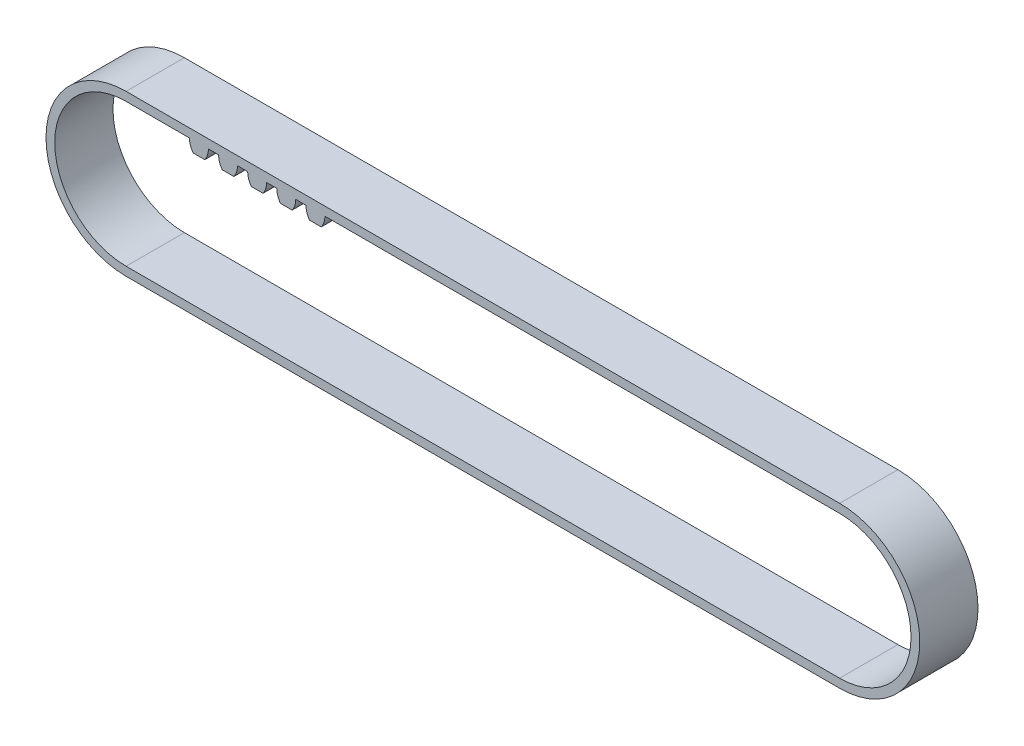
ISO-10303-21;
HEADER;
FILE_DESCRIPTION(('STEP AP214'),'2;1');
FILE_NAME('part.step','',(''),(''),'','','');
FILE_SCHEMA(('AUTOMOTIVE_DESIGN { 1 0 10303 214 1 1 1 1 }'));
ENDSEC;
DATA;
#1=APPLICATION_CONTEXT('core data for automotive mechanical design processes');
#2=APPLICATION_PROTOCOL_DEFINITION('international standard','automotive_design',2000,#1);
#3=PRODUCT_CONTEXT('',#1,'mechanical');
#4=PRODUCT('Part','Part','',(#3));
#5=PRODUCT_RELATED_PRODUCT_CATEGORY('part','',(#4));
#6=PRODUCT_DEFINITION_FORMATION('','',#4);
#7=PRODUCT_DEFINITION_CONTEXT('part definition',#1,'design');
#8=PRODUCT_DEFINITION('design','',#6,#7);
#9=PRODUCT_DEFINITION_SHAPE('','',#8);
#10=(LENGTH_UNIT() NAMED_UNIT(*) SI_UNIT(.MILLI.,.METRE.));
#11=(NAMED_UNIT(*) PLANE_ANGLE_UNIT() SI_UNIT($,.RADIAN.));
#12=(NAMED_UNIT(*) SI_UNIT($,.STERADIAN.) SOLID_ANGLE_UNIT());
#13=UNCERTAINTY_MEASURE_WITH_UNIT(LENGTH_MEASURE(1.E-05),#10,'distance_accuracy_value','');
#14=(GEOMETRIC_REPRESENTATION_CONTEXT(3) GLOBAL_UNCERTAINTY_ASSIGNED_CONTEXT((#13)) GLOBAL_UNIT_ASSIGNED_CONTEXT((#10,
#11,#12)) REPRESENTATION_CONTEXT('',''));
#15=CARTESIAN_POINT('',(0.,0.,0.));
#16=DIRECTION('',(0.,0.,1.));
#17=DIRECTION('',(1.,0.,0.));
#18=AXIS2_PLACEMENT_3D('',#15,#16,#17);
#19=CARTESIAN_POINT('',(122.5,0.,5.));
#20=DIRECTION('',(0.,0.,-1.));
#21=DIRECTION('',(-1.,0.,0.));
#22=AXIS2_PLACEMENT_3D('',#19,#20,#21);
#23=CYLINDRICAL_SURFACE('',#22,13.7523955);
#24=CARTESIAN_POINT('',(122.5,0.,-5.));
#25=DIRECTION('',(0.,0.,1.));
#26=DIRECTION('',(1.,0.,0.));
#27=AXIS2_PLACEMENT_3D('',#24,#25,#26);
#28=CIRCLE('',#27,13.7523955);
#29=CARTESIAN_POINT('',(122.5,-13.7523955,-5.));
#30=VERTEX_POINT('',#29);
#31=CARTESIAN_POINT('',(122.5,13.7523955,-5.));
#32=VERTEX_POINT('',#31);
#33=EDGE_CURVE('E301',#30,#32,#28,.T.);
#34=ORIENTED_EDGE('',*,*,#33,.T.);
#35=DIRECTION('',(0.,0.,-1.));
#36=VECTOR('',#35,1.);
#37=CARTESIAN_POINT('',(122.5,13.7523955,5.));
#38=LINE('',#37,#36);
#39=CARTESIAN_POINT('',(122.5,13.7523955,5.));
#40=VERTEX_POINT('',#39);
#41=EDGE_CURVE('E467',#40,#32,#38,.T.);
#42=ORIENTED_EDGE('',*,*,#41,.F.);
#43=CARTESIAN_POINT('',(122.5,0.,5.));
#44=DIRECTION('',(0.,0.,1.));
#45=DIRECTION('',(1.,0.,0.));
#46=AXIS2_PLACEMENT_3D('',#43,#44,#45);
#47=CIRCLE('',#46,13.7523955);
#48=CARTESIAN_POINT('',(122.5,-13.7523955,5.));
#49=VERTEX_POINT('',#48);
#50=EDGE_CURVE('E320',#49,#40,#47,.T.);
#51=ORIENTED_EDGE('',*,*,#50,.F.);
#52=DIRECTION('',(0.,0.,-1.));
#53=VECTOR('',#52,1.);
#54=CARTESIAN_POINT('',(122.5,-13.7523955,5.));
#55=LINE('',#54,#53);
#56=EDGE_CURVE('E36',#49,#30,#55,.T.);
#57=ORIENTED_EDGE('',*,*,#56,.T.);
#58=EDGE_LOOP('',(#34,#42,#51,#57));
#59=FACE_BOUND('',#58,.T.);
#60=ADVANCED_FACE('F16',(#59),#23,.T.);
#61=CARTESIAN_POINT('',(0.,0.,5.));
#62=DIRECTION('',(0.,0.,-1.));
#63=DIRECTION('',(-1.,0.,0.));
#64=AXIS2_PLACEMENT_3D('',#61,#62,#63);
#65=CYLINDRICAL_SURFACE('',#64,12.2523955);
#66=CARTESIAN_POINT('',(0.,0.,-5.));
#67=DIRECTION('',(0.,0.,1.));
#68=DIRECTION('',(1.,0.,0.));
#69=AXIS2_PLACEMENT_3D('',#66,#67,#68);
#70=CIRCLE('',#69,12.2523955);
#71=CARTESIAN_POINT('',(0.,12.2523955,-5.));
#72=VERTEX_POINT('',#71);
#73=CARTESIAN_POINT('',(0.,-12.2523955,-5.));
#74=VERTEX_POINT('',#73);
#75=EDGE_CURVE('E459',#72,#74,#70,.T.);
#76=ORIENTED_EDGE('',*,*,#75,.F.);
#77=DIRECTION('',(0.,0.,-1.));
#78=VECTOR('',#77,1.);
#79=CARTESIAN_POINT('',(0.,12.2523955,5.));
#80=LINE('',#79,#78);
#81=CARTESIAN_POINT('',(0.,12.2523955,5.));
#82=VERTEX_POINT('',#81);
#83=EDGE_CURVE('E520',#82,#72,#80,.T.);
#84=ORIENTED_EDGE('',*,*,#83,.F.);
#85=CARTESIAN_POINT('',(0.,0.,5.));
#86=DIRECTION('',(0.,0.,1.));
#87=DIRECTION('',(1.,0.,0.));
#88=AXIS2_PLACEMENT_3D('',#85,#86,#87);
#89=CIRCLE('',#88,12.2523955);
#90=CARTESIAN_POINT('',(0.,-12.2523955,5.));
#91=VERTEX_POINT('',#90);
#92=EDGE_CURVE('E471',#82,#91,#89,.T.);
#93=ORIENTED_EDGE('',*,*,#92,.T.);
#94=DIRECTION('',(0.,0.,-1.));
#95=VECTOR('',#94,1.);
#96=CARTESIAN_POINT('',(0.,-12.2523955,5.));
#97=LINE('',#96,#95);
#98=EDGE_CURVE('E10',#91,#74,#97,.T.);
#99=ORIENTED_EDGE('',*,*,#98,.T.);
#100=EDGE_LOOP('',(#76,#84,#93,#99));
#101=FACE_BOUND('',#100,.T.);
#102=ADVANCED_FACE('F714',(#101),#65,.F.);
#103=CARTESIAN_POINT('',(0.,-12.2523955,5.));
#104=DIRECTION('',(0.,1.,0.));
#105=DIRECTION('',(1.,0.,0.));
#106=AXIS2_PLACEMENT_3D('',#103,#104,#105);
#107=PLANE('',#106);
#108=DIRECTION('',(1.,0.,0.));
#109=VECTOR('',#108,1.);
#110=CARTESIAN_POINT('',(0.,-12.2523955,-5.));
#111=LINE('',#110,#109);
#112=CARTESIAN_POINT('',(122.5,-12.2523955,-5.));
#113=VERTEX_POINT('',#112);
#114=EDGE_CURVE('E463',#74,#113,#111,.T.);
#115=ORIENTED_EDGE('',*,*,#114,.F.);
#116=ORIENTED_EDGE('',*,*,#98,.F.);
#117=DIRECTION('',(1.,0.,0.));
#118=VECTOR('',#117,1.);
#119=CARTESIAN_POINT('',(0.,-12.2523955,5.));
#120=LINE('',#119,#118);
#121=CARTESIAN_POINT('',(122.5,-12.2523955,5.));
#122=VERTEX_POINT('',#121);
#123=EDGE_CURVE('E479',#91,#122,#120,.T.);
#124=ORIENTED_EDGE('',*,*,#123,.T.);
#125=DIRECTION('',(0.,0.,-1.));
#126=VECTOR('',#125,1.);
#127=CARTESIAN_POINT('',(122.5,-12.2523955,5.));
#128=LINE('',#127,#126);
#129=EDGE_CURVE('E24',#122,#113,#128,.T.);
#130=ORIENTED_EDGE('',*,*,#129,.T.);
#131=EDGE_LOOP('',(#115,#116,#124,#130));
#132=FACE_BOUND('',#131,.T.);
#133=ADVANCED_FACE('F498',(#132),#107,.T.);
#134=CARTESIAN_POINT('',(122.5,0.,5.));
#135=DIRECTION('',(0.,0.,-1.));
#136=DIRECTION('',(-1.,0.,0.));
#137=AXIS2_PLACEMENT_3D('',#134,#135,#136);
#138=CYLINDRICAL_SURFACE('',#137,12.2523955);
#139=CARTESIAN_POINT('',(122.5,0.,-5.));
#140=DIRECTION('',(0.,0.,1.));
#141=DIRECTION('',(1.,0.,0.));
#142=AXIS2_PLACEMENT_3D('',#139,#140,#141);
#143=CIRCLE('',#142,12.2523955);
#144=CARTESIAN_POINT('',(122.5,12.2523955,-5.));
#145=VERTEX_POINT('',#144);
#146=EDGE_CURVE('E490',#113,#145,#143,.T.);
#147=ORIENTED_EDGE('',*,*,#146,.F.);
#148=ORIENTED_EDGE('',*,*,#129,.F.);
#149=CARTESIAN_POINT('',(122.5,0.,5.));
#150=DIRECTION('',(0.,0.,1.));
#151=DIRECTION('',(1.,0.,0.));
#152=AXIS2_PLACEMENT_3D('',#149,#150,#151);
#153=CIRCLE('',#152,12.2523955);
#154=CARTESIAN_POINT('',(122.5,12.2523955,5.));
#155=VERTEX_POINT('',#154);
#156=EDGE_CURVE('E476',#122,#155,#153,.T.);
#157=ORIENTED_EDGE('',*,*,#156,.T.);
#158=DIRECTION('',(0.,0.,-1.));
#159=VECTOR('',#158,1.);
#160=CARTESIAN_POINT('',(122.5,12.2523955,5.));
#161=LINE('',#160,#159);
#162=EDGE_CURVE('E455',#155,#145,#161,.T.);
#163=ORIENTED_EDGE('',*,*,#162,.T.);
#164=EDGE_LOOP('',(#147,#148,#157,#163));
#165=FACE_BOUND('',#164,.T.);
#166=ADVANCED_FACE('F503',(#165),#138,.F.);
#167=CARTESIAN_POINT('',(0.,-13.7523955,5.));
#168=DIRECTION('',(0.,1.,0.));
#169=DIRECTION('',(1.,0.,0.));
#170=AXIS2_PLACEMENT_3D('',#167,#168,#169);
#171=PLANE('',#170);
#172=DIRECTION('',(1.,0.,0.));
#173=VECTOR('',#172,1.);
#174=CARTESIAN_POINT('',(0.,-13.7523955,-5.));
#175=LINE('',#174,#173);
#176=CARTESIAN_POINT('',(0.,-13.7523955,-5.));
#177=VERTEX_POINT('',#176);
#178=EDGE_CURVE('E383',#177,#30,#175,.T.);
#179=ORIENTED_EDGE('',*,*,#178,.T.);
#180=ORIENTED_EDGE('',*,*,#56,.F.);
#181=DIRECTION('',(1.,0.,0.));
#182=VECTOR('',#181,1.);
#183=CARTESIAN_POINT('',(0.,-13.7523955,5.));
#184=LINE('',#183,#182);
#185=CARTESIAN_POINT('',(0.,-13.7523955,5.));
#186=VERTEX_POINT('',#185);
#187=EDGE_CURVE('E316',#186,#49,#184,.T.);
#188=ORIENTED_EDGE('',*,*,#187,.F.);
#189=DIRECTION('',(0.,0.,-1.));
#190=VECTOR('',#189,1.);
#191=CARTESIAN_POINT('',(0.,-13.7523955,5.));
#192=LINE('',#191,#190);
#193=EDGE_CURVE('E45',#186,#177,#192,.T.);
#194=ORIENTED_EDGE('',*,*,#193,.T.);
#195=EDGE_LOOP('',(#179,#180,#188,#194));
#196=FACE_BOUND('',#195,.T.);
#197=ADVANCED_FACE('F610',(#196),#171,.F.);
#198=CARTESIAN_POINT('',(0.,0.,5.));
#199=DIRECTION('',(0.,0.,-1.));
#200=DIRECTION('',(-1.,0.,0.));
#201=AXIS2_PLACEMENT_3D('',#198,#199,#200);
#202=CYLINDRICAL_SURFACE('',#201,13.7523955);
#203=CARTESIAN_POINT('',(0.,0.,-5.));
#204=DIRECTION('',(0.,0.,1.));
#205=DIRECTION('',(1.,0.,0.));
#206=AXIS2_PLACEMENT_3D('',#203,#204,#205);
#207=CIRCLE('',#206,13.7523955);
#208=CARTESIAN_POINT('',(0.,13.7523955,-5.));
#209=VERTEX_POINT('',#208);
#210=EDGE_CURVE('E486',#209,#177,#207,.T.);
#211=ORIENTED_EDGE('',*,*,#210,.T.);
#212=ORIENTED_EDGE('',*,*,#193,.F.);
#213=CARTESIAN_POINT('',(0.,0.,5.));
#214=DIRECTION('',(0.,0.,1.));
#215=DIRECTION('',(1.,0.,0.));
#216=AXIS2_PLACEMENT_3D('',#213,#214,#215);
#217=CIRCLE('',#216,13.7523955);
#218=CARTESIAN_POINT('',(0.,13.7523955,5.));
#219=VERTEX_POINT('',#218);
#220=EDGE_CURVE('E321',#219,#186,#217,.T.);
#221=ORIENTED_EDGE('',*,*,#220,.F.);
#222=DIRECTION('',(0.,0.,-1.));
#223=VECTOR('',#222,1.);
#224=CARTESIAN_POINT('',(0.,13.7523955,5.));
#225=LINE('',#224,#223);
#226=EDGE_CURVE('E306',#219,#209,#225,.T.);
#227=ORIENTED_EDGE('',*,*,#226,.T.);
#228=EDGE_LOOP('',(#211,#212,#221,#227));
#229=FACE_BOUND('',#228,.T.);
#230=ADVANCED_FACE('F609',(#229),#202,.T.);
#231=CARTESIAN_POINT('',(14.125,12.2523955,-5.));
#232=DIRECTION('',(0.,0.,1.));
#233=DIRECTION('',(1.,0.,0.));
#234=AXIS2_PLACEMENT_3D('',#231,#232,#233);
#235=PLANE('',#234);
#236=ORIENTED_EDGE('',*,*,#210,.F.);
#237=DIRECTION('',(-1.,0.,0.));
#238=VECTOR('',#237,1.);
#239=CARTESIAN_POINT('',(35.,13.7523955,-5.));
#240=LINE('',#239,#238);
#241=EDGE_CURVE('E302',#32,#209,#240,.T.);
#242=ORIENTED_EDGE('',*,*,#241,.F.);
#243=ORIENTED_EDGE('',*,*,#33,.F.);
#244=ORIENTED_EDGE('',*,*,#178,.F.);
#245=EDGE_LOOP('',(#236,#242,#243,#244));
#246=FACE_BOUND('',#245,.T.);
#247=DIRECTION('',(1.,0.,0.));
#248=VECTOR('',#247,1.);
#249=CARTESIAN_POINT('',(10.,12.2523955,-5.));
#250=LINE('',#249,#248);
#251=CARTESIAN_POINT('',(10.875,12.2523955,-5.));
#252=VERTEX_POINT('',#251);
#253=EDGE_CURVE('E699',#72,#252,#250,.T.);
#254=ORIENTED_EDGE('',*,*,#253,.F.);
#255=ORIENTED_EDGE('',*,*,#75,.T.);
#256=ORIENTED_EDGE('',*,*,#114,.T.);
#257=ORIENTED_EDGE('',*,*,#146,.T.);
#258=DIRECTION('',(1.,0.,0.));
#259=VECTOR('',#258,1.);
#260=CARTESIAN_POINT('',(34.125,12.2523955,-5.));
#261=LINE('',#260,#259);
#262=CARTESIAN_POINT('',(34.125,12.2523955,-5.));
#263=VERTEX_POINT('',#262);
#264=EDGE_CURVE('E403',#263,#145,#261,.T.);
#265=ORIENTED_EDGE('',*,*,#264,.F.);
#266=CARTESIAN_POINT('',(30.875,12.2523955,-5.));
#267=DIRECTION('',(0.,0.,1.));
#268=DIRECTION('',(1.,0.,0.));
#269=AXIS2_PLACEMENT_3D('',#266,#267,#268);
#270=CIRCLE('',#269,3.25000000000007);
#271=CARTESIAN_POINT('',(33.5045246718751,10.3423955,-5.));
#272=VERTEX_POINT('',#271);
#273=EDGE_CURVE('E445',#272,#263,#270,.T.);
#274=ORIENTED_EDGE('',*,*,#273,.F.);
#275=DIRECTION('',(1.,0.,0.));
#276=VECTOR('',#275,1.);
#277=CARTESIAN_POINT('',(31.4954753281249,10.3423955,-5.));
#278=LINE('',#277,#276);
#279=CARTESIAN_POINT('',(31.4954753281249,10.3423955,-5.));
#280=VERTEX_POINT('',#279);
#281=EDGE_CURVE('E348',#280,#272,#278,.T.);
#282=ORIENTED_EDGE('',*,*,#281,.F.);
#283=CARTESIAN_POINT('',(34.125,12.2523955,-5.));
#284=DIRECTION('',(0.,0.,1.));
#285=DIRECTION('',(1.,0.,0.));
#286=AXIS2_PLACEMENT_3D('',#283,#284,#285);
#287=CIRCLE('',#286,3.25000000000004);
#288=CARTESIAN_POINT('',(30.875,12.2523955,-5.));
#289=VERTEX_POINT('',#288);
#290=EDGE_CURVE('E314',#289,#280,#287,.T.);
#291=ORIENTED_EDGE('',*,*,#290,.F.);
#292=DIRECTION('',(1.,0.,0.));
#293=VECTOR('',#292,1.);
#294=CARTESIAN_POINT('',(29.125,12.2523955,-5.));
#295=LINE('',#294,#293);
#296=CARTESIAN_POINT('',(29.125,12.2523955,-5.));
#297=VERTEX_POINT('',#296);
#298=EDGE_CURVE('E419',#297,#289,#295,.T.);
#299=ORIENTED_EDGE('',*,*,#298,.F.);
#300=CARTESIAN_POINT('',(25.875,12.2523955,-5.));
#301=DIRECTION('',(0.,0.,1.));
#302=DIRECTION('',(1.,0.,0.));
#303=AXIS2_PLACEMENT_3D('',#300,#301,#302);
#304=CIRCLE('',#303,3.25);
#305=CARTESIAN_POINT('',(28.5045246718751,10.3423955,-5.));
#306=VERTEX_POINT('',#305);
#307=EDGE_CURVE('E357',#306,#297,#304,.T.);
#308=ORIENTED_EDGE('',*,*,#307,.F.);
#309=DIRECTION('',(1.,0.,0.));
#310=VECTOR('',#309,1.);
#311=CARTESIAN_POINT('',(26.4954753281249,10.3423955,-5.));
#312=LINE('',#311,#310);
#313=CARTESIAN_POINT('',(26.4954753281249,10.3423955,-5.));
#314=VERTEX_POINT('',#313);
#315=EDGE_CURVE('E326',#314,#306,#312,.T.);
#316=ORIENTED_EDGE('',*,*,#315,.F.);
#317=CARTESIAN_POINT('',(29.125,12.2523955,-5.));
#318=DIRECTION('',(0.,0.,1.));
#319=DIRECTION('',(1.,0.,0.));
#320=AXIS2_PLACEMENT_3D('',#317,#318,#319);
#321=CIRCLE('',#320,3.25);
#322=CARTESIAN_POINT('',(25.875,12.2523955,-5.));
#323=VERTEX_POINT('',#322);
#324=EDGE_CURVE('E376',#323,#314,#321,.T.);
#325=ORIENTED_EDGE('',*,*,#324,.F.);
#326=DIRECTION('',(1.,0.,0.));
#327=VECTOR('',#326,1.);
#328=CARTESIAN_POINT('',(24.125,12.2523955,-5.));
#329=LINE('',#328,#327);
#330=CARTESIAN_POINT('',(24.125,12.2523955,-5.));
#331=VERTEX_POINT('',#330);
#332=EDGE_CURVE('E387',#331,#323,#329,.T.);
#333=ORIENTED_EDGE('',*,*,#332,.F.);
#334=CARTESIAN_POINT('',(20.875,12.2523955,-5.));
#335=DIRECTION('',(0.,0.,1.));
#336=DIRECTION('',(1.,0.,0.));
#337=AXIS2_PLACEMENT_3D('',#334,#335,#336);
#338=CIRCLE('',#337,3.25);
#339=CARTESIAN_POINT('',(23.5045246718751,10.3423955,-5.));
#340=VERTEX_POINT('',#339);
#341=EDGE_CURVE('E366',#340,#331,#338,.T.);
#342=ORIENTED_EDGE('',*,*,#341,.F.);
#343=DIRECTION('',(1.,0.,0.));
#344=VECTOR('',#343,1.);
#345=CARTESIAN_POINT('',(21.4954753281249,10.3423955,-5.));
#346=LINE('',#345,#344);
#347=CARTESIAN_POINT('',(21.4954753281249,10.3423955,-5.));
#348=VERTEX_POINT('',#347);
#349=EDGE_CURVE('E344',#348,#340,#346,.T.);
#350=ORIENTED_EDGE('',*,*,#349,.F.);
#351=CARTESIAN_POINT('',(24.125,12.2523955,-5.));
#352=DIRECTION('',(0.,0.,1.));
#353=DIRECTION('',(1.,0.,0.));
#354=AXIS2_PLACEMENT_3D('',#351,#352,#353);
#355=CIRCLE('',#354,3.25);
#356=CARTESIAN_POINT('',(20.875,12.2523955,-5.));
#357=VERTEX_POINT('',#356);
#358=EDGE_CURVE('E335',#357,#348,#355,.T.);
#359=ORIENTED_EDGE('',*,*,#358,.F.);
#360=DIRECTION('',(1.,0.,0.));
#361=VECTOR('',#360,1.);
#362=CARTESIAN_POINT('',(19.125,12.2523955,-5.));
#363=LINE('',#362,#361);
#364=CARTESIAN_POINT('',(19.125,12.2523955,-5.));
#365=VERTEX_POINT('',#364);
#366=EDGE_CURVE('E269',#365,#357,#363,.T.);
#367=ORIENTED_EDGE('',*,*,#366,.F.);
#368=CARTESIAN_POINT('',(15.875,12.2523955,-5.));
#369=DIRECTION('',(0.,0.,1.));
#370=DIRECTION('',(1.,0.,0.));
#371=AXIS2_PLACEMENT_3D('',#368,#369,#370);
#372=CIRCLE('',#371,3.25);
#373=CARTESIAN_POINT('',(18.5045246718751,10.3423955,-5.));
#374=VERTEX_POINT('',#373);
#375=EDGE_CURVE('E261',#374,#365,#372,.T.);
#376=ORIENTED_EDGE('',*,*,#375,.F.);
#377=DIRECTION('',(1.,0.,0.));
#378=VECTOR('',#377,1.);
#379=CARTESIAN_POINT('',(16.4954753281249,10.3423955,-5.));
#380=LINE('',#379,#378);
#381=CARTESIAN_POINT('',(16.4954753281249,10.3423955,-5.));
#382=VERTEX_POINT('',#381);
#383=EDGE_CURVE('E266',#382,#374,#380,.T.);
#384=ORIENTED_EDGE('',*,*,#383,.F.);
#385=CARTESIAN_POINT('',(19.125,12.2523955,-5.));
#386=DIRECTION('',(0.,0.,1.));
#387=DIRECTION('',(1.,0.,0.));
#388=AXIS2_PLACEMENT_3D('',#385,#386,#387);
#389=CIRCLE('',#388,3.25);
#390=CARTESIAN_POINT('',(15.875,12.2523955,-5.));
#391=VERTEX_POINT('',#390);
#392=EDGE_CURVE('E543',#391,#382,#389,.T.);
#393=ORIENTED_EDGE('',*,*,#392,.F.);
#394=DIRECTION('',(1.,0.,0.));
#395=VECTOR('',#394,1.);
#396=CARTESIAN_POINT('',(14.125,12.2523955,-5.));
#397=LINE('',#396,#395);
#398=CARTESIAN_POINT('',(14.125,12.2523955,-5.));
#399=VERTEX_POINT('',#398);
#400=EDGE_CURVE('E548',#399,#391,#397,.T.);
#401=ORIENTED_EDGE('',*,*,#400,.F.);
#402=CARTESIAN_POINT('',(10.875,12.2523955,-5.));
#403=DIRECTION('',(0.,0.,1.));
#404=DIRECTION('',(1.,0.,0.));
#405=AXIS2_PLACEMENT_3D('',#402,#403,#404);
#406=CIRCLE('',#405,3.25);
#407=CARTESIAN_POINT('',(13.5045246718751,10.3423955,-5.));
#408=VERTEX_POINT('',#407);
#409=EDGE_CURVE('E573',#408,#399,#406,.T.);
#410=ORIENTED_EDGE('',*,*,#409,.F.);
#411=DIRECTION('',(1.,0.,0.));
#412=VECTOR('',#411,1.);
#413=CARTESIAN_POINT('',(11.4954753281249,10.3423955,-5.));
#414=LINE('',#413,#412);
#415=CARTESIAN_POINT('',(11.4954753281249,10.3423955,-5.));
#416=VERTEX_POINT('',#415);
#417=EDGE_CURVE('E559',#416,#408,#414,.T.);
#418=ORIENTED_EDGE('',*,*,#417,.F.);
#419=CARTESIAN_POINT('',(14.125,12.2523955,-5.));
#420=DIRECTION('',(0.,0.,1.));
#421=DIRECTION('',(1.,0.,0.));
#422=AXIS2_PLACEMENT_3D('',#419,#420,#421);
#423=CIRCLE('',#422,3.25);
#424=EDGE_CURVE('E515',#252,#416,#423,.T.);
#425=ORIENTED_EDGE('',*,*,#424,.F.);
#426=EDGE_LOOP('',(#254,#255,#256,#257,#265,#274,#282,#291,#299,#308,#316,#325,#333,#342,#350,
#359,#367,#376,#384,#393,#401,#410,#418,#425));
#427=FACE_BOUND('',#426,.T.);
#428=ADVANCED_FACE('F264',(#246,#427),#235,.F.);
#429=CARTESIAN_POINT('',(14.125,12.2523955,5.));
#430=DIRECTION('',(0.,0.,1.));
#431=DIRECTION('',(1.,0.,0.));
#432=AXIS2_PLACEMENT_3D('',#429,#430,#431);
#433=PLANE('',#432);
#434=DIRECTION('',(-1.,0.,0.));
#435=VECTOR('',#434,1.);
#436=CARTESIAN_POINT('',(35.,13.7523955,5.));
#437=LINE('',#436,#435);
#438=EDGE_CURVE('E472',#40,#219,#437,.T.);
#439=ORIENTED_EDGE('',*,*,#438,.T.);
#440=ORIENTED_EDGE('',*,*,#220,.T.);
#441=ORIENTED_EDGE('',*,*,#187,.T.);
#442=ORIENTED_EDGE('',*,*,#50,.T.);
#443=EDGE_LOOP('',(#439,#440,#441,#442));
#444=FACE_BOUND('',#443,.T.);
#445=ORIENTED_EDGE('',*,*,#92,.F.);
#446=DIRECTION('',(1.,0.,0.));
#447=VECTOR('',#446,1.);
#448=CARTESIAN_POINT('',(10.,12.2523955,5.));
#449=LINE('',#448,#447);
#450=CARTESIAN_POINT('',(10.875,12.2523955,5.));
#451=VERTEX_POINT('',#450);
#452=EDGE_CURVE('E524',#82,#451,#449,.T.);
#453=ORIENTED_EDGE('',*,*,#452,.T.);
#454=CARTESIAN_POINT('',(14.125,12.2523955,5.));
#455=DIRECTION('',(0.,0.,1.));
#456=DIRECTION('',(1.,0.,0.));
#457=AXIS2_PLACEMENT_3D('',#454,#455,#456);
#458=CIRCLE('',#457,3.25);
#459=CARTESIAN_POINT('',(11.4954753281249,10.3423955,5.));
#460=VERTEX_POINT('',#459);
#461=EDGE_CURVE('E552',#451,#460,#458,.T.);
#462=ORIENTED_EDGE('',*,*,#461,.T.);
#463=DIRECTION('',(1.,0.,0.));
#464=VECTOR('',#463,1.);
#465=CARTESIAN_POINT('',(11.4954753281249,10.3423955,5.));
#466=LINE('',#465,#464);
#467=CARTESIAN_POINT('',(13.5045246718751,10.3423955,5.));
#468=VERTEX_POINT('',#467);
#469=EDGE_CURVE('E569',#460,#468,#466,.T.);
#470=ORIENTED_EDGE('',*,*,#469,.T.);
#471=CARTESIAN_POINT('',(10.875,12.2523955,5.));
#472=DIRECTION('',(0.,0.,1.));
#473=DIRECTION('',(1.,0.,0.));
#474=AXIS2_PLACEMENT_3D('',#471,#472,#473);
#475=CIRCLE('',#474,3.25);
#476=CARTESIAN_POINT('',(14.125,12.2523955,5.));
#477=VERTEX_POINT('',#476);
#478=EDGE_CURVE('E578',#468,#477,#475,.T.);
#479=ORIENTED_EDGE('',*,*,#478,.T.);
#480=DIRECTION('',(1.,0.,0.));
#481=VECTOR('',#480,1.);
#482=CARTESIAN_POINT('',(14.125,12.2523955,5.));
#483=LINE('',#482,#481);
#484=CARTESIAN_POINT('',(15.875,12.2523955,5.));
#485=VERTEX_POINT('',#484);
#486=EDGE_CURVE('E539',#477,#485,#483,.T.);
#487=ORIENTED_EDGE('',*,*,#486,.T.);
#488=CARTESIAN_POINT('',(19.125,12.2523955,5.));
#489=DIRECTION('',(0.,0.,1.));
#490=DIRECTION('',(1.,0.,0.));
#491=AXIS2_PLACEMENT_3D('',#488,#489,#490);
#492=CIRCLE('',#491,3.25);
#493=CARTESIAN_POINT('',(16.4954753281249,10.3423955,5.));
#494=VERTEX_POINT('',#493);
#495=EDGE_CURVE('E291',#485,#494,#492,.T.);
#496=ORIENTED_EDGE('',*,*,#495,.T.);
#497=DIRECTION('',(1.,0.,0.));
#498=VECTOR('',#497,1.);
#499=CARTESIAN_POINT('',(16.4954753281249,10.3423955,5.));
#500=LINE('',#499,#498);
#501=CARTESIAN_POINT('',(18.5045246718751,10.3423955,5.));
#502=VERTEX_POINT('',#501);
#503=EDGE_CURVE('E275',#494,#502,#500,.T.);
#504=ORIENTED_EDGE('',*,*,#503,.T.);
#505=CARTESIAN_POINT('',(15.875,12.2523955,5.));
#506=DIRECTION('',(0.,0.,1.));
#507=DIRECTION('',(1.,0.,0.));
#508=AXIS2_PLACEMENT_3D('',#505,#506,#507);
#509=CIRCLE('',#508,3.25);
#510=CARTESIAN_POINT('',(19.125,12.2523955,5.));
#511=VERTEX_POINT('',#510);
#512=EDGE_CURVE('E281',#502,#511,#509,.T.);
#513=ORIENTED_EDGE('',*,*,#512,.T.);
#514=DIRECTION('',(1.,0.,0.));
#515=VECTOR('',#514,1.);
#516=CARTESIAN_POINT('',(19.125,12.2523955,5.));
#517=LINE('',#516,#515);
#518=CARTESIAN_POINT('',(20.875,12.2523955,5.));
#519=VERTEX_POINT('',#518);
#520=EDGE_CURVE('E334',#511,#519,#517,.T.);
#521=ORIENTED_EDGE('',*,*,#520,.T.);
#522=CARTESIAN_POINT('',(24.125,12.2523955,5.));
#523=DIRECTION('',(0.,0.,1.));
#524=DIRECTION('',(1.,0.,0.));
#525=AXIS2_PLACEMENT_3D('',#522,#523,#524);
#526=CIRCLE('',#525,3.25);
#527=CARTESIAN_POINT('',(21.4954753281249,10.3423955,5.));
#528=VERTEX_POINT('',#527);
#529=EDGE_CURVE('E340',#519,#528,#526,.T.);
#530=ORIENTED_EDGE('',*,*,#529,.T.);
#531=DIRECTION('',(1.,0.,0.));
#532=VECTOR('',#531,1.);
#533=CARTESIAN_POINT('',(21.4954753281249,10.3423955,5.));
#534=LINE('',#533,#532);
#535=CARTESIAN_POINT('',(23.5045246718751,10.3423955,5.));
#536=VERTEX_POINT('',#535);
#537=EDGE_CURVE('E362',#528,#536,#534,.T.);
#538=ORIENTED_EDGE('',*,*,#537,.T.);
#539=CARTESIAN_POINT('',(20.875,12.2523955,5.));
#540=DIRECTION('',(0.,0.,1.));
#541=DIRECTION('',(1.,0.,0.));
#542=AXIS2_PLACEMENT_3D('',#539,#540,#541);
#543=CIRCLE('',#542,3.25);
#544=CARTESIAN_POINT('',(24.125,12.2523955,5.));
#545=VERTEX_POINT('',#544);
#546=EDGE_CURVE('E380',#536,#545,#543,.T.);
#547=ORIENTED_EDGE('',*,*,#546,.T.);
#548=DIRECTION('',(1.,0.,0.));
#549=VECTOR('',#548,1.);
#550=CARTESIAN_POINT('',(24.125,12.2523955,5.));
#551=LINE('',#550,#549);
#552=CARTESIAN_POINT('',(25.875,12.2523955,5.));
#553=VERTEX_POINT('',#552);
#554=EDGE_CURVE('E395',#545,#553,#551,.T.);
#555=ORIENTED_EDGE('',*,*,#554,.T.);
#556=CARTESIAN_POINT('',(29.125,12.2523955,5.));
#557=DIRECTION('',(0.,0.,1.));
#558=DIRECTION('',(1.,0.,0.));
#559=AXIS2_PLACEMENT_3D('',#556,#557,#558);
#560=CIRCLE('',#559,3.25);
#561=CARTESIAN_POINT('',(26.4954753281249,10.3423955,5.));
#562=VERTEX_POINT('',#561);
#563=EDGE_CURVE('E322',#553,#562,#560,.T.);
#564=ORIENTED_EDGE('',*,*,#563,.T.);
#565=DIRECTION('',(1.,0.,0.));
#566=VECTOR('',#565,1.);
#567=CARTESIAN_POINT('',(26.4954753281249,10.3423955,5.));
#568=LINE('',#567,#566);
#569=CARTESIAN_POINT('',(28.5045246718751,10.3423955,5.));
#570=VERTEX_POINT('',#569);
#571=EDGE_CURVE('E353',#562,#570,#568,.T.);
#572=ORIENTED_EDGE('',*,*,#571,.T.);
#573=CARTESIAN_POINT('',(25.875,12.2523955,5.));
#574=DIRECTION('',(0.,0.,1.));
#575=DIRECTION('',(1.,0.,0.));
#576=AXIS2_PLACEMENT_3D('',#573,#574,#575);
#577=CIRCLE('',#576,3.25);
#578=CARTESIAN_POINT('',(29.125,12.2523955,5.));
#579=VERTEX_POINT('',#578);
#580=EDGE_CURVE('E415',#570,#579,#577,.T.);
#581=ORIENTED_EDGE('',*,*,#580,.T.);
#582=DIRECTION('',(1.,0.,0.));
#583=VECTOR('',#582,1.);
#584=CARTESIAN_POINT('',(29.125,12.2523955,5.));
#585=LINE('',#584,#583);
#586=CARTESIAN_POINT('',(30.875,12.2523955,5.));
#587=VERTEX_POINT('',#586);
#588=EDGE_CURVE('E427',#579,#587,#585,.T.);
#589=ORIENTED_EDGE('',*,*,#588,.T.);
#590=CARTESIAN_POINT('',(34.125,12.2523955,5.));
#591=DIRECTION('',(0.,0.,1.));
#592=DIRECTION('',(1.,0.,0.));
#593=AXIS2_PLACEMENT_3D('',#590,#591,#592);
#594=CIRCLE('',#593,3.25000000000004);
#595=CARTESIAN_POINT('',(31.4954753281249,10.3423955,5.));
#596=VERTEX_POINT('',#595);
#597=EDGE_CURVE('E313',#587,#596,#594,.T.);
#598=ORIENTED_EDGE('',*,*,#597,.T.);
#599=DIRECTION('',(1.,0.,0.));
#600=VECTOR('',#599,1.);
#601=CARTESIAN_POINT('',(31.4954753281249,10.3423955,5.));
#602=LINE('',#601,#600);
#603=CARTESIAN_POINT('',(33.5045246718751,10.3423955,5.));
#604=VERTEX_POINT('',#603);
#605=EDGE_CURVE('E441',#596,#604,#602,.T.);
#606=ORIENTED_EDGE('',*,*,#605,.T.);
#607=CARTESIAN_POINT('',(30.875,12.2523955,5.));
#608=DIRECTION('',(0.,0.,1.));
#609=DIRECTION('',(1.,0.,0.));
#610=AXIS2_PLACEMENT_3D('',#607,#608,#609);
#611=CIRCLE('',#610,3.25000000000007);
#612=CARTESIAN_POINT('',(34.125,12.2523955,5.));
#613=VERTEX_POINT('',#612);
#614=EDGE_CURVE('E399',#604,#613,#611,.T.);
#615=ORIENTED_EDGE('',*,*,#614,.T.);
#616=DIRECTION('',(1.,0.,0.));
#617=VECTOR('',#616,1.);
#618=CARTESIAN_POINT('',(34.125,12.2523955,5.));
#619=LINE('',#618,#617);
#620=EDGE_CURVE('E307',#613,#155,#619,.T.);
#621=ORIENTED_EDGE('',*,*,#620,.T.);
#622=ORIENTED_EDGE('',*,*,#156,.F.);
#623=ORIENTED_EDGE('',*,*,#123,.F.);
#624=EDGE_LOOP('',(#445,#453,#462,#470,#479,#487,#496,#504,#513,#521,#530,#538,#547,#555,#564,
#572,#581,#589,#598,#606,#615,#621,#622,#623));
#625=FACE_BOUND('',#624,.T.);
#626=ADVANCED_FACE('F600',(#444,#625),#433,.T.);
#627=CARTESIAN_POINT('',(35.,13.7523955,5.));
#628=DIRECTION('',(0.,-1.,0.));
#629=DIRECTION('',(0.,0.,-1.));
#630=AXIS2_PLACEMENT_3D('',#627,#628,#629);
#631=PLANE('',#630);
#632=ORIENTED_EDGE('',*,*,#241,.T.);
#633=ORIENTED_EDGE('',*,*,#226,.F.);
#634=ORIENTED_EDGE('',*,*,#438,.F.);
#635=ORIENTED_EDGE('',*,*,#41,.T.);
#636=EDGE_LOOP('',(#632,#633,#634,#635));
#637=FACE_BOUND('',#636,.T.);
#638=ADVANCED_FACE('F607',(#637),#631,.F.);
#639=CARTESIAN_POINT('',(34.125,12.2523955,5.));
#640=DIRECTION('',(0.,1.,0.));
#641=DIRECTION('',(1.,0.,0.));
#642=AXIS2_PLACEMENT_3D('',#639,#640,#641);
#643=PLANE('',#642);
#644=ORIENTED_EDGE('',*,*,#264,.T.);
#645=ORIENTED_EDGE('',*,*,#162,.F.);
#646=ORIENTED_EDGE('',*,*,#620,.F.);
#647=DIRECTION('',(0.,0.,-1.));
#648=VECTOR('',#647,1.);
#649=CARTESIAN_POINT('',(34.125,12.2523955,5.));
#650=LINE('',#649,#648);
#651=EDGE_CURVE('E404',#613,#263,#650,.T.);
#652=ORIENTED_EDGE('',*,*,#651,.T.);
#653=EDGE_LOOP('',(#644,#645,#646,#652));
#654=FACE_BOUND('',#653,.T.);
#655=ADVANCED_FACE('F731',(#654),#643,.F.);
#656=CARTESIAN_POINT('',(30.875,12.2523955,5.));
#657=DIRECTION('',(0.,0.,-1.));
#658=DIRECTION('',(-1.,0.,0.));
#659=AXIS2_PLACEMENT_3D('',#656,#657,#658);
#660=CYLINDRICAL_SURFACE('',#659,3.25000000000007);
#661=ORIENTED_EDGE('',*,*,#273,.T.);
#662=ORIENTED_EDGE('',*,*,#651,.F.);
#663=ORIENTED_EDGE('',*,*,#614,.F.);
#664=DIRECTION('',(0.,0.,-1.));
#665=VECTOR('',#664,1.);
#666=CARTESIAN_POINT('',(33.5045246718751,10.3423955,5.));
#667=LINE('',#666,#665);
#668=EDGE_CURVE('E437',#604,#272,#667,.T.);
#669=ORIENTED_EDGE('',*,*,#668,.T.);
#670=EDGE_LOOP('',(#661,#662,#663,#669));
#671=FACE_BOUND('',#670,.T.);
#672=ADVANCED_FACE('F734',(#671),#660,.T.);
#673=CARTESIAN_POINT('',(31.4954753281249,10.3423955,5.));
#674=DIRECTION('',(0.,1.,0.));
#675=DIRECTION('',(1.,0.,0.));
#676=AXIS2_PLACEMENT_3D('',#673,#674,#675);
#677=PLANE('',#676);
#678=ORIENTED_EDGE('',*,*,#281,.T.);
#679=ORIENTED_EDGE('',*,*,#668,.F.);
#680=ORIENTED_EDGE('',*,*,#605,.F.);
#681=DIRECTION('',(0.,0.,-1.));
#682=VECTOR('',#681,1.);
#683=CARTESIAN_POINT('',(31.4954753281249,10.3423955,5.));
#684=LINE('',#683,#682);
#685=EDGE_CURVE('E310',#596,#280,#684,.T.);
#686=ORIENTED_EDGE('',*,*,#685,.T.);
#687=EDGE_LOOP('',(#678,#679,#680,#686));
#688=FACE_BOUND('',#687,.T.);
#689=ADVANCED_FACE('F738',(#688),#677,.F.);
#690=CARTESIAN_POINT('',(34.125,12.2523955,5.));
#691=DIRECTION('',(0.,0.,-1.));
#692=DIRECTION('',(-1.,0.,0.));
#693=AXIS2_PLACEMENT_3D('',#690,#691,#692);
#694=CYLINDRICAL_SURFACE('',#693,3.25000000000004);
#695=ORIENTED_EDGE('',*,*,#290,.T.);
#696=ORIENTED_EDGE('',*,*,#685,.F.);
#697=ORIENTED_EDGE('',*,*,#597,.F.);
#698=DIRECTION('',(0.,0.,-1.));
#699=VECTOR('',#698,1.);
#700=CARTESIAN_POINT('',(30.875,12.2523955,5.));
#701=LINE('',#700,#699);
#702=EDGE_CURVE('E423',#587,#289,#701,.T.);
#703=ORIENTED_EDGE('',*,*,#702,.T.);
#704=EDGE_LOOP('',(#695,#696,#697,#703));
#705=FACE_BOUND('',#704,.T.);
#706=ADVANCED_FACE('F742',(#705),#694,.T.);
#707=CARTESIAN_POINT('',(29.125,12.2523955,5.));
#708=DIRECTION('',(0.,1.,0.));
#709=DIRECTION('',(1.,0.,0.));
#710=AXIS2_PLACEMENT_3D('',#707,#708,#709);
#711=PLANE('',#710);
#712=ORIENTED_EDGE('',*,*,#298,.T.);
#713=ORIENTED_EDGE('',*,*,#702,.F.);
#714=ORIENTED_EDGE('',*,*,#588,.F.);
#715=DIRECTION('',(0.,0.,-1.));
#716=VECTOR('',#715,1.);
#717=CARTESIAN_POINT('',(29.125,12.2523955,5.));
#718=LINE('',#717,#716);
#719=EDGE_CURVE('E411',#579,#297,#718,.T.);
#720=ORIENTED_EDGE('',*,*,#719,.T.);
#721=EDGE_LOOP('',(#712,#713,#714,#720));
#722=FACE_BOUND('',#721,.T.);
#723=ADVANCED_FACE('F746',(#722),#711,.F.);
#724=CARTESIAN_POINT('',(25.875,12.2523955,5.));
#725=DIRECTION('',(0.,0.,-1.));
#726=DIRECTION('',(-1.,0.,0.));
#727=AXIS2_PLACEMENT_3D('',#724,#725,#726);
#728=CYLINDRICAL_SURFACE('',#727,3.25);
#729=ORIENTED_EDGE('',*,*,#307,.T.);
#730=ORIENTED_EDGE('',*,*,#719,.F.);
#731=ORIENTED_EDGE('',*,*,#580,.F.);
#732=DIRECTION('',(0.,0.,-1.));
#733=VECTOR('',#732,1.);
#734=CARTESIAN_POINT('',(28.5045246718751,10.3423955,5.));
#735=LINE('',#734,#733);
#736=EDGE_CURVE('E358',#570,#306,#735,.T.);
#737=ORIENTED_EDGE('',*,*,#736,.T.);
#738=EDGE_LOOP('',(#729,#730,#731,#737));
#739=FACE_BOUND('',#738,.T.);
#740=ADVANCED_FACE('F750',(#739),#728,.T.);
#741=CARTESIAN_POINT('',(26.4954753281249,10.3423955,5.));
#742=DIRECTION('',(0.,1.,0.));
#743=DIRECTION('',(1.,0.,0.));
#744=AXIS2_PLACEMENT_3D('',#741,#742,#743);
#745=PLANE('',#744);
#746=ORIENTED_EDGE('',*,*,#315,.T.);
#747=ORIENTED_EDGE('',*,*,#736,.F.);
#748=ORIENTED_EDGE('',*,*,#571,.F.);
#749=DIRECTION('',(0.,0.,-1.));
#750=VECTOR('',#749,1.);
#751=CARTESIAN_POINT('',(26.4954753281249,10.3423955,5.));
#752=LINE('',#751,#750);
#753=EDGE_CURVE('E327',#562,#314,#752,.T.);
#754=ORIENTED_EDGE('',*,*,#753,.T.);
#755=EDGE_LOOP('',(#746,#747,#748,#754));
#756=FACE_BOUND('',#755,.T.);
#757=ADVANCED_FACE('F754',(#756),#745,.F.);
#758=CARTESIAN_POINT('',(29.125,12.2523955,5.));
#759=DIRECTION('',(0.,0.,-1.));
#760=DIRECTION('',(-1.,0.,0.));
#761=AXIS2_PLACEMENT_3D('',#758,#759,#760);
#762=CYLINDRICAL_SURFACE('',#761,3.25);
#763=ORIENTED_EDGE('',*,*,#324,.T.);
#764=ORIENTED_EDGE('',*,*,#753,.F.);
#765=ORIENTED_EDGE('',*,*,#563,.F.);
#766=DIRECTION('',(0.,0.,-1.));
#767=VECTOR('',#766,1.);
#768=CARTESIAN_POINT('',(25.875,12.2523955,5.));
#769=LINE('',#768,#767);
#770=EDGE_CURVE('E391',#553,#323,#769,.T.);
#771=ORIENTED_EDGE('',*,*,#770,.T.);
#772=EDGE_LOOP('',(#763,#764,#765,#771));
#773=FACE_BOUND('',#772,.T.);
#774=ADVANCED_FACE('F756',(#773),#762,.T.);
#775=CARTESIAN_POINT('',(24.125,12.2523955,5.));
#776=DIRECTION('',(0.,1.,0.));
#777=DIRECTION('',(1.,0.,0.));
#778=AXIS2_PLACEMENT_3D('',#775,#776,#777);
#779=PLANE('',#778);
#780=ORIENTED_EDGE('',*,*,#332,.T.);
#781=ORIENTED_EDGE('',*,*,#770,.F.);
#782=ORIENTED_EDGE('',*,*,#554,.F.);
#783=DIRECTION('',(0.,0.,-1.));
#784=VECTOR('',#783,1.);
#785=CARTESIAN_POINT('',(24.125,12.2523955,5.));
#786=LINE('',#785,#784);
#787=EDGE_CURVE('E372',#545,#331,#786,.T.);
#788=ORIENTED_EDGE('',*,*,#787,.T.);
#789=EDGE_LOOP('',(#780,#781,#782,#788));
#790=FACE_BOUND('',#789,.T.);
#791=ADVANCED_FACE('F759',(#790),#779,.F.);
#792=CARTESIAN_POINT('',(20.875,12.2523955,5.));
#793=DIRECTION('',(0.,0.,-1.));
#794=DIRECTION('',(-1.,0.,0.));
#795=AXIS2_PLACEMENT_3D('',#792,#793,#794);
#796=CYLINDRICAL_SURFACE('',#795,3.25);
#797=ORIENTED_EDGE('',*,*,#341,.T.);
#798=ORIENTED_EDGE('',*,*,#787,.F.);
#799=ORIENTED_EDGE('',*,*,#546,.F.);
#800=DIRECTION('',(0.,0.,-1.));
#801=VECTOR('',#800,1.);
#802=CARTESIAN_POINT('',(23.5045246718751,10.3423955,5.));
#803=LINE('',#802,#801);
#804=EDGE_CURVE('E352',#536,#340,#803,.T.);
#805=ORIENTED_EDGE('',*,*,#804,.T.);
#806=EDGE_LOOP('',(#797,#798,#799,#805));
#807=FACE_BOUND('',#806,.T.);
#808=ADVANCED_FACE('F763',(#807),#796,.T.);
#809=CARTESIAN_POINT('',(21.4954753281249,10.3423955,5.));
#810=DIRECTION('',(0.,1.,0.));
#811=DIRECTION('',(1.,0.,0.));
#812=AXIS2_PLACEMENT_3D('',#809,#810,#811);
#813=PLANE('',#812);
#814=ORIENTED_EDGE('',*,*,#349,.T.);
#815=ORIENTED_EDGE('',*,*,#804,.F.);
#816=ORIENTED_EDGE('',*,*,#537,.F.);
#817=DIRECTION('',(0.,0.,-1.));
#818=VECTOR('',#817,1.);
#819=CARTESIAN_POINT('',(21.4954753281249,10.3423955,5.));
#820=LINE('',#819,#818);
#821=EDGE_CURVE('E339',#528,#348,#820,.T.);
#822=ORIENTED_EDGE('',*,*,#821,.T.);
#823=EDGE_LOOP('',(#814,#815,#816,#822));
#824=FACE_BOUND('',#823,.T.);
#825=ADVANCED_FACE('F768',(#824),#813,.F.);
#826=CARTESIAN_POINT('',(24.125,12.2523955,5.));
#827=DIRECTION('',(0.,0.,-1.));
#828=DIRECTION('',(-1.,0.,0.));
#829=AXIS2_PLACEMENT_3D('',#826,#827,#828);
#830=CYLINDRICAL_SURFACE('',#829,3.25);
#831=ORIENTED_EDGE('',*,*,#358,.T.);
#832=ORIENTED_EDGE('',*,*,#821,.F.);
#833=ORIENTED_EDGE('',*,*,#529,.F.);
#834=DIRECTION('',(0.,0.,-1.));
#835=VECTOR('',#834,1.);
#836=CARTESIAN_POINT('',(20.875,12.2523955,5.));
#837=LINE('',#836,#835);
#838=EDGE_CURVE('E330',#519,#357,#837,.T.);
#839=ORIENTED_EDGE('',*,*,#838,.T.);
#840=EDGE_LOOP('',(#831,#832,#833,#839));
#841=FACE_BOUND('',#840,.T.);
#842=ADVANCED_FACE('F765',(#841),#830,.T.);
#843=CARTESIAN_POINT('',(19.125,12.2523955,5.));
#844=DIRECTION('',(0.,1.,0.));
#845=DIRECTION('',(1.,0.,0.));
#846=AXIS2_PLACEMENT_3D('',#843,#844,#845);
#847=PLANE('',#846);
#848=ORIENTED_EDGE('',*,*,#366,.T.);
#849=ORIENTED_EDGE('',*,*,#838,.F.);
#850=ORIENTED_EDGE('',*,*,#520,.F.);
#851=DIRECTION('',(0.,0.,-1.));
#852=VECTOR('',#851,1.);
#853=CARTESIAN_POINT('',(19.125,12.2523955,5.));
#854=LINE('',#853,#852);
#855=EDGE_CURVE('E274',#511,#365,#854,.T.);
#856=ORIENTED_EDGE('',*,*,#855,.T.);
#857=EDGE_LOOP('',(#848,#849,#850,#856));
#858=FACE_BOUND('',#857,.T.);
#859=ADVANCED_FACE('F767',(#858),#847,.F.);
#860=CARTESIAN_POINT('',(15.875,12.2523955,5.));
#861=DIRECTION('',(0.,0.,-1.));
#862=DIRECTION('',(-1.,0.,0.));
#863=AXIS2_PLACEMENT_3D('',#860,#861,#862);
#864=CYLINDRICAL_SURFACE('',#863,3.25);
#865=ORIENTED_EDGE('',*,*,#375,.T.);
#866=ORIENTED_EDGE('',*,*,#855,.F.);
#867=ORIENTED_EDGE('',*,*,#512,.F.);
#868=DIRECTION('',(0.,0.,-1.));
#869=VECTOR('',#868,1.);
#870=CARTESIAN_POINT('',(18.5045246718751,10.3423955,5.));
#871=LINE('',#870,#869);
#872=EDGE_CURVE('E278',#502,#374,#871,.T.);
#873=ORIENTED_EDGE('',*,*,#872,.T.);
#874=EDGE_LOOP('',(#865,#866,#867,#873));
#875=FACE_BOUND('',#874,.T.);
#876=ADVANCED_FACE('F279',(#875),#864,.T.);
#877=CARTESIAN_POINT('',(16.4954753281249,10.3423955,5.));
#878=DIRECTION('',(0.,1.,0.));
#879=DIRECTION('',(1.,0.,0.));
#880=AXIS2_PLACEMENT_3D('',#877,#878,#879);
#881=PLANE('',#880);
#882=ORIENTED_EDGE('',*,*,#383,.T.);
#883=ORIENTED_EDGE('',*,*,#872,.F.);
#884=ORIENTED_EDGE('',*,*,#503,.F.);
#885=DIRECTION('',(0.,0.,-1.));
#886=VECTOR('',#885,1.);
#887=CARTESIAN_POINT('',(16.4954753281249,10.3423955,5.));
#888=LINE('',#887,#886);
#889=EDGE_CURVE('E288',#494,#382,#888,.T.);
#890=ORIENTED_EDGE('',*,*,#889,.T.);
#891=EDGE_LOOP('',(#882,#883,#884,#890));
#892=FACE_BOUND('',#891,.T.);
#893=ADVANCED_FACE('F286',(#892),#881,.F.);
#894=CARTESIAN_POINT('',(19.125,12.2523955,5.));
#895=DIRECTION('',(0.,0.,-1.));
#896=DIRECTION('',(-1.,0.,0.));
#897=AXIS2_PLACEMENT_3D('',#894,#895,#896);
#898=CYLINDRICAL_SURFACE('',#897,3.25);
#899=ORIENTED_EDGE('',*,*,#392,.T.);
#900=ORIENTED_EDGE('',*,*,#889,.F.);
#901=ORIENTED_EDGE('',*,*,#495,.F.);
#902=DIRECTION('',(0.,0.,-1.));
#903=VECTOR('',#902,1.);
#904=CARTESIAN_POINT('',(15.875,12.2523955,5.));
#905=LINE('',#904,#903);
#906=EDGE_CURVE('E544',#485,#391,#905,.T.);
#907=ORIENTED_EDGE('',*,*,#906,.T.);
#908=EDGE_LOOP('',(#899,#900,#901,#907));
#909=FACE_BOUND('',#908,.T.);
#910=ADVANCED_FACE('F780',(#909),#898,.T.);
#911=CARTESIAN_POINT('',(14.125,12.2523955,5.));
#912=DIRECTION('',(0.,1.,0.));
#913=DIRECTION('',(1.,0.,0.));
#914=AXIS2_PLACEMENT_3D('',#911,#912,#913);
#915=PLANE('',#914);
#916=ORIENTED_EDGE('',*,*,#400,.T.);
#917=ORIENTED_EDGE('',*,*,#906,.F.);
#918=ORIENTED_EDGE('',*,*,#486,.F.);
#919=DIRECTION('',(0.,0.,-1.));
#920=VECTOR('',#919,1.);
#921=CARTESIAN_POINT('',(14.125,12.2523955,5.));
#922=LINE('',#921,#920);
#923=EDGE_CURVE('E577',#477,#399,#922,.T.);
#924=ORIENTED_EDGE('',*,*,#923,.T.);
#925=EDGE_LOOP('',(#916,#917,#918,#924));
#926=FACE_BOUND('',#925,.T.);
#927=ADVANCED_FACE('F786',(#926),#915,.F.);
#928=CARTESIAN_POINT('',(10.875,12.2523955,5.));
#929=DIRECTION('',(0.,0.,-1.));
#930=DIRECTION('',(-1.,0.,0.));
#931=AXIS2_PLACEMENT_3D('',#928,#929,#930);
#932=CYLINDRICAL_SURFACE('',#931,3.25);
#933=ORIENTED_EDGE('',*,*,#409,.T.);
#934=ORIENTED_EDGE('',*,*,#923,.F.);
#935=ORIENTED_EDGE('',*,*,#478,.F.);
#936=DIRECTION('',(0.,0.,-1.));
#937=VECTOR('',#936,1.);
#938=CARTESIAN_POINT('',(13.5045246718751,10.3423955,5.));
#939=LINE('',#938,#937);
#940=EDGE_CURVE('E565',#468,#408,#939,.T.);
#941=ORIENTED_EDGE('',*,*,#940,.T.);
#942=EDGE_LOOP('',(#933,#934,#935,#941));
#943=FACE_BOUND('',#942,.T.);
#944=ADVANCED_FACE('F793',(#943),#932,.T.);
#945=CARTESIAN_POINT('',(11.4954753281249,10.3423955,5.));
#946=DIRECTION('',(0.,1.,0.));
#947=DIRECTION('',(1.,0.,0.));
#948=AXIS2_PLACEMENT_3D('',#945,#946,#947);
#949=PLANE('',#948);
#950=ORIENTED_EDGE('',*,*,#417,.T.);
#951=ORIENTED_EDGE('',*,*,#940,.F.);
#952=ORIENTED_EDGE('',*,*,#469,.F.);
#953=DIRECTION('',(0.,0.,-1.));
#954=VECTOR('',#953,1.);
#955=CARTESIAN_POINT('',(11.4954753281249,10.3423955,5.));
#956=LINE('',#955,#954);
#957=EDGE_CURVE('E519',#460,#416,#956,.T.);
#958=ORIENTED_EDGE('',*,*,#957,.T.);
#959=EDGE_LOOP('',(#950,#951,#952,#958));
#960=FACE_BOUND('',#959,.T.);
#961=ADVANCED_FACE('F800',(#960),#949,.F.);
#962=CARTESIAN_POINT('',(14.125,12.2523955,5.));
#963=DIRECTION('',(0.,0.,-1.));
#964=DIRECTION('',(-1.,0.,0.));
#965=AXIS2_PLACEMENT_3D('',#962,#963,#964);
#966=CYLINDRICAL_SURFACE('',#965,3.25);
#967=ORIENTED_EDGE('',*,*,#424,.T.);
#968=ORIENTED_EDGE('',*,*,#957,.F.);
#969=ORIENTED_EDGE('',*,*,#461,.F.);
#970=DIRECTION('',(0.,0.,-1.));
#971=VECTOR('',#970,1.);
#972=CARTESIAN_POINT('',(10.875,12.2523955,5.));
#973=LINE('',#972,#971);
#974=EDGE_CURVE('E512',#451,#252,#973,.T.);
#975=ORIENTED_EDGE('',*,*,#974,.T.);
#976=EDGE_LOOP('',(#967,#968,#969,#975));
#977=FACE_BOUND('',#976,.T.);
#978=ADVANCED_FACE('F712',(#977),#966,.T.);
#979=CARTESIAN_POINT('',(10.,12.2523955,5.));
#980=DIRECTION('',(0.,1.,0.));
#981=DIRECTION('',(1.,0.,0.));
#982=AXIS2_PLACEMENT_3D('',#979,#980,#981);
#983=PLANE('',#982);
#984=ORIENTED_EDGE('',*,*,#253,.T.);
#985=ORIENTED_EDGE('',*,*,#974,.F.);
#986=ORIENTED_EDGE('',*,*,#452,.F.);
#987=ORIENTED_EDGE('',*,*,#83,.T.);
#988=EDGE_LOOP('',(#984,#985,#986,#987));
#989=FACE_BOUND('',#988,.T.);
#990=ADVANCED_FACE('F707',(#989),#983,.F.);
#991=CLOSED_SHELL('',(#60,#102,#133,#166,#197,#230,#428,#626,#638,#655,#672,#689,#706,#723,#740,
#757,#774,#791,#808,#825,#842,#859,#876,#893,#910,#927,#944,#961,#978,#990));
#992=MANIFOLD_SOLID_BREP('B1',#991);
#993=ADVANCED_BREP_SHAPE_REPRESENTATION('',(#18,#992),#14);
#994=SHAPE_DEFINITION_REPRESENTATION(#9,#993);
ENDSEC;
END-ISO-10303-21;
